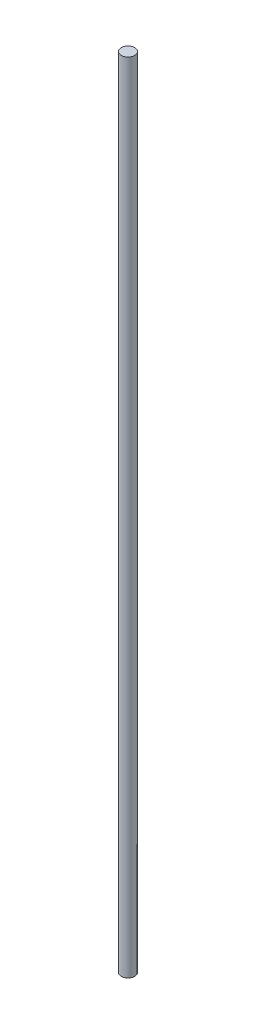
ISO-10303-21;
HEADER;
FILE_DESCRIPTION(('STEP AP214'),'2;1');
FILE_NAME('part.step','',(''),(''),'','','');
FILE_SCHEMA(('AUTOMOTIVE_DESIGN { 1 0 10303 214 1 1 1 1 }'));
ENDSEC;
DATA;
#1=APPLICATION_CONTEXT('core data for automotive mechanical design processes');
#2=APPLICATION_PROTOCOL_DEFINITION('international standard','automotive_design',2000,#1);
#3=PRODUCT_CONTEXT('',#1,'mechanical');
#4=PRODUCT('Part','Part','',(#3));
#5=PRODUCT_RELATED_PRODUCT_CATEGORY('part','',(#4));
#6=PRODUCT_DEFINITION_FORMATION('','',#4);
#7=PRODUCT_DEFINITION_CONTEXT('part definition',#1,'design');
#8=PRODUCT_DEFINITION('design','',#6,#7);
#9=PRODUCT_DEFINITION_SHAPE('','',#8);
#10=(LENGTH_UNIT() NAMED_UNIT(*) SI_UNIT(.MILLI.,.METRE.));
#11=(NAMED_UNIT(*) PLANE_ANGLE_UNIT() SI_UNIT($,.RADIAN.));
#12=(NAMED_UNIT(*) SI_UNIT($,.STERADIAN.) SOLID_ANGLE_UNIT());
#13=UNCERTAINTY_MEASURE_WITH_UNIT(LENGTH_MEASURE(1.E-05),#10,'distance_accuracy_value','');
#14=(GEOMETRIC_REPRESENTATION_CONTEXT(3) GLOBAL_UNCERTAINTY_ASSIGNED_CONTEXT((#13)) GLOBAL_UNIT_ASSIGNED_CONTEXT((#10,
#11,#12)) REPRESENTATION_CONTEXT('',''));
#15=CARTESIAN_POINT('',(0.,0.,0.));
#16=DIRECTION('',(0.,0.,1.));
#17=DIRECTION('',(1.,0.,0.));
#18=AXIS2_PLACEMENT_3D('',#15,#16,#17);
#19=CARTESIAN_POINT('',(0.,533.,0.));
#20=DIRECTION('',(0.,-1.,0.));
#21=DIRECTION('',(0.,0.,-1.));
#22=AXIS2_PLACEMENT_3D('',#19,#20,#21);
#23=CYLINDRICAL_SURFACE('',#22,4.5);
#24=CARTESIAN_POINT('',(0.,533.,0.));
#25=DIRECTION('',(0.,1.,0.));
#26=DIRECTION('',(0.,0.,1.));
#27=AXIS2_PLACEMENT_3D('',#24,#25,#26);
#28=CIRCLE('',#27,4.5);
#29=CARTESIAN_POINT('',(0.,533.,4.5));
#30=VERTEX_POINT('',#29);
#31=EDGE_CURVE('E10',#30,#30,#28,.T.);
#32=ORIENTED_EDGE('',*,*,#31,.F.);
#33=EDGE_LOOP('',(#32));
#34=FACE_BOUND('',#33,.T.);
#35=CARTESIAN_POINT('',(0.,0.,0.));
#36=DIRECTION('',(0.,1.,0.));
#37=DIRECTION('',(0.,0.,1.));
#38=AXIS2_PLACEMENT_3D('',#35,#36,#37);
#39=CIRCLE('',#38,4.5);
#40=CARTESIAN_POINT('',(0.,0.,4.5));
#41=VERTEX_POINT('',#40);
#42=EDGE_CURVE('E38',#41,#41,#39,.T.);
#43=ORIENTED_EDGE('',*,*,#42,.T.);
#44=EDGE_LOOP('',(#43));
#45=FACE_BOUND('',#44,.T.);
#46=ADVANCED_FACE('F35',(#34,#45),#23,.T.);
#47=CARTESIAN_POINT('',(0.,533.,0.));
#48=DIRECTION('',(0.,1.,0.));
#49=DIRECTION('',(0.,0.,1.));
#50=AXIS2_PLACEMENT_3D('',#47,#48,#49);
#51=PLANE('',#50);
#52=ORIENTED_EDGE('',*,*,#31,.T.);
#53=EDGE_LOOP('',(#52));
#54=FACE_BOUND('',#53,.T.);
#55=ADVANCED_FACE('F50',(#54),#51,.T.);
#56=CARTESIAN_POINT('',(0.,0.,0.));
#57=DIRECTION('',(0.,1.,0.));
#58=DIRECTION('',(0.,0.,1.));
#59=AXIS2_PLACEMENT_3D('',#56,#57,#58);
#60=PLANE('',#59);
#61=ORIENTED_EDGE('',*,*,#42,.F.);
#62=EDGE_LOOP('',(#61));
#63=FACE_BOUND('',#62,.T.);
#64=ADVANCED_FACE('F48',(#63),#60,.F.);
#65=CLOSED_SHELL('',(#46,#55,#64));
#66=MANIFOLD_SOLID_BREP('B2',#65);
#67=ADVANCED_BREP_SHAPE_REPRESENTATION('',(#18,#66),#14);
#68=SHAPE_DEFINITION_REPRESENTATION(#9,#67);
ENDSEC;
END-ISO-10303-21;
